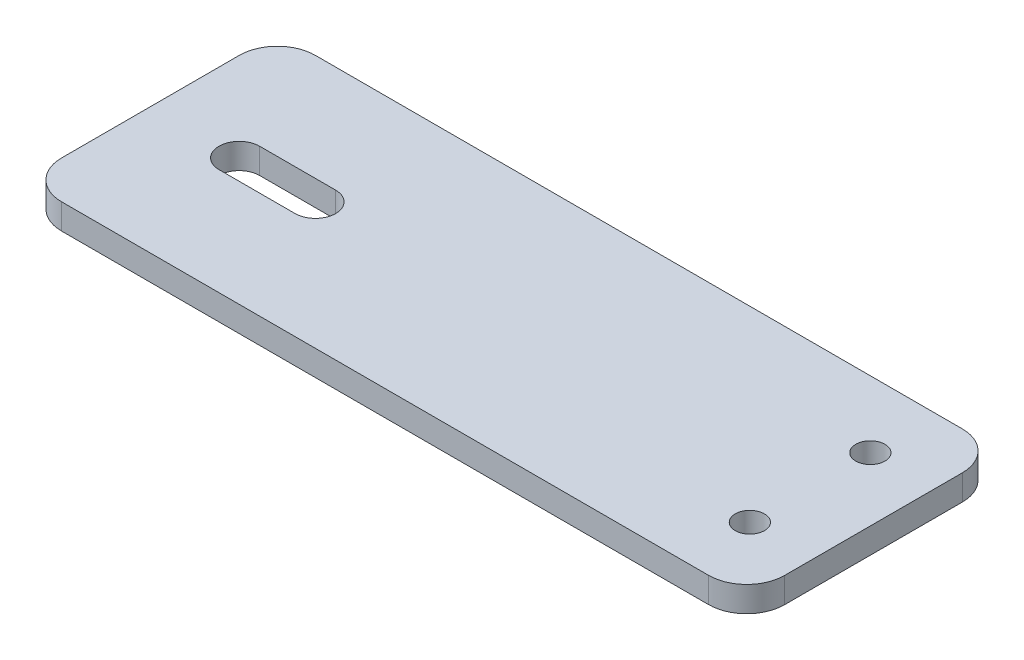
ISO-10303-21;
HEADER;
FILE_DESCRIPTION(('STEP AP214'),'2;1');
FILE_NAME('part.step','',(''),(''),'','','');
FILE_SCHEMA(('AUTOMOTIVE_DESIGN { 1 0 10303 214 1 1 1 1 }'));
ENDSEC;
DATA;
#1=APPLICATION_CONTEXT('core data for automotive mechanical design processes');
#2=APPLICATION_PROTOCOL_DEFINITION('international standard','automotive_design',2000,#1);
#3=PRODUCT_CONTEXT('',#1,'mechanical');
#4=PRODUCT('Part','Part','',(#3));
#5=PRODUCT_RELATED_PRODUCT_CATEGORY('part','',(#4));
#6=PRODUCT_DEFINITION_FORMATION('','',#4);
#7=PRODUCT_DEFINITION_CONTEXT('part definition',#1,'design');
#8=PRODUCT_DEFINITION('design','',#6,#7);
#9=PRODUCT_DEFINITION_SHAPE('','',#8);
#10=(LENGTH_UNIT() NAMED_UNIT(*) SI_UNIT(.MILLI.,.METRE.));
#11=(NAMED_UNIT(*) PLANE_ANGLE_UNIT() SI_UNIT($,.RADIAN.));
#12=(NAMED_UNIT(*) SI_UNIT($,.STERADIAN.) SOLID_ANGLE_UNIT());
#13=UNCERTAINTY_MEASURE_WITH_UNIT(LENGTH_MEASURE(1.E-05),#10,'distance_accuracy_value','');
#14=(GEOMETRIC_REPRESENTATION_CONTEXT(3) GLOBAL_UNCERTAINTY_ASSIGNED_CONTEXT((#13)) GLOBAL_UNIT_ASSIGNED_CONTEXT((#10,
#11,#12)) REPRESENTATION_CONTEXT('',''));
#15=CARTESIAN_POINT('',(0.,0.,0.));
#16=DIRECTION('',(0.,0.,1.));
#17=DIRECTION('',(1.,0.,0.));
#18=AXIS2_PLACEMENT_3D('',#15,#16,#17);
#19=CARTESIAN_POINT('',(0.,2.,0.));
#20=DIRECTION('',(0.,1.,0.));
#21=DIRECTION('',(0.,0.,1.));
#22=AXIS2_PLACEMENT_3D('',#19,#20,#21);
#23=PLANE('',#22);
#24=CARTESIAN_POINT('',(-3.,2.,0.));
#25=DIRECTION('',(0.,1.,0.));
#26=DIRECTION('',(0.,0.,1.));
#27=AXIS2_PLACEMENT_3D('',#24,#25,#26);
#28=CIRCLE('',#27,1.6);
#29=CARTESIAN_POINT('',(-3.,2.,-1.6));
#30=VERTEX_POINT('',#29);
#31=CARTESIAN_POINT('',(-3.,2.,1.6));
#32=VERTEX_POINT('',#31);
#33=EDGE_CURVE('E159',#30,#32,#28,.T.);
#34=ORIENTED_EDGE('',*,*,#33,.F.);
#35=DIRECTION('',(-1.,0.,0.));
#36=VECTOR('',#35,1.);
#37=CARTESIAN_POINT('',(0.,2.,-1.6));
#38=LINE('',#37,#36);
#39=CARTESIAN_POINT('',(3.,2.,-1.6));
#40=VERTEX_POINT('',#39);
#41=EDGE_CURVE('E152',#40,#30,#38,.T.);
#42=ORIENTED_EDGE('',*,*,#41,.F.);
#43=CARTESIAN_POINT('',(3.,2.,0.));
#44=DIRECTION('',(0.,1.,0.));
#45=DIRECTION('',(0.,0.,1.));
#46=AXIS2_PLACEMENT_3D('',#43,#44,#45);
#47=CIRCLE('',#46,1.6);
#48=CARTESIAN_POINT('',(3.,2.,1.6));
#49=VERTEX_POINT('',#48);
#50=EDGE_CURVE('E131',#49,#40,#47,.T.);
#51=ORIENTED_EDGE('',*,*,#50,.F.);
#52=DIRECTION('',(1.,0.,0.));
#53=VECTOR('',#52,1.);
#54=CARTESIAN_POINT('',(0.,2.,1.6));
#55=LINE('',#54,#53);
#56=EDGE_CURVE('E156',#32,#49,#55,.T.);
#57=ORIENTED_EDGE('',*,*,#56,.F.);
#58=EDGE_LOOP('',(#34,#42,#51,#57));
#59=FACE_BOUND('',#58,.T.);
#60=CARTESIAN_POINT('',(42.,2.,4.75));
#61=DIRECTION('',(0.,1.,0.));
#62=DIRECTION('',(0.,0.,1.));
#63=AXIS2_PLACEMENT_3D('',#60,#61,#62);
#64=CIRCLE('',#63,1.15);
#65=CARTESIAN_POINT('',(42.,2.,5.9));
#66=VERTEX_POINT('',#65);
#67=EDGE_CURVE('E168',#66,#66,#64,.T.);
#68=ORIENTED_EDGE('',*,*,#67,.F.);
#69=EDGE_LOOP('',(#68));
#70=FACE_BOUND('',#69,.T.);
#71=DIRECTION('',(-1.,0.,0.));
#72=VECTOR('',#71,1.);
#73=CARTESIAN_POINT('',(10.,2.,-10.));
#74=LINE('',#73,#72);
#75=CARTESIAN_POINT('',(44.,2.,-10.));
#76=VERTEX_POINT('',#75);
#77=CARTESIAN_POINT('',(-7.,2.,-10.));
#78=VERTEX_POINT('',#77);
#79=EDGE_CURVE('E183',#76,#78,#74,.T.);
#80=ORIENTED_EDGE('',*,*,#79,.T.);
#81=CARTESIAN_POINT('',(-7.,2.,-7.));
#82=DIRECTION('',(0.,1.,0.));
#83=DIRECTION('',(0.,0.,1.));
#84=AXIS2_PLACEMENT_3D('',#81,#82,#83);
#85=CIRCLE('',#84,3.);
#86=CARTESIAN_POINT('',(-10.,2.,-7.));
#87=VERTEX_POINT('',#86);
#88=EDGE_CURVE('E219',#78,#87,#85,.T.);
#89=ORIENTED_EDGE('',*,*,#88,.T.);
#90=DIRECTION('',(0.,0.,1.));
#91=VECTOR('',#90,1.);
#92=CARTESIAN_POINT('',(-10.,2.,-10.));
#93=LINE('',#92,#91);
#94=CARTESIAN_POINT('',(-10.,2.,7.));
#95=VERTEX_POINT('',#94);
#96=EDGE_CURVE('E174',#87,#95,#93,.T.);
#97=ORIENTED_EDGE('',*,*,#96,.T.);
#98=CARTESIAN_POINT('',(-7.,2.,7.));
#99=DIRECTION('',(0.,1.,0.));
#100=DIRECTION('',(0.,0.,1.));
#101=AXIS2_PLACEMENT_3D('',#98,#99,#100);
#102=CIRCLE('',#101,3.);
#103=CARTESIAN_POINT('',(-7.,2.,10.));
#104=VERTEX_POINT('',#103);
#105=EDGE_CURVE('E217',#95,#104,#102,.T.);
#106=ORIENTED_EDGE('',*,*,#105,.T.);
#107=DIRECTION('',(1.,0.,0.));
#108=VECTOR('',#107,1.);
#109=CARTESIAN_POINT('',(-10.,2.,10.));
#110=LINE('',#109,#108);
#111=CARTESIAN_POINT('',(44.,2.,10.));
#112=VERTEX_POINT('',#111);
#113=EDGE_CURVE('E177',#104,#112,#110,.T.);
#114=ORIENTED_EDGE('',*,*,#113,.T.);
#115=CARTESIAN_POINT('',(44.,2.,7.));
#116=DIRECTION('',(0.,1.,0.));
#117=DIRECTION('',(0.,0.,1.));
#118=AXIS2_PLACEMENT_3D('',#115,#116,#117);
#119=CIRCLE('',#118,3.);
#120=CARTESIAN_POINT('',(47.,2.,7.));
#121=VERTEX_POINT('',#120);
#122=EDGE_CURVE('E213',#112,#121,#119,.T.);
#123=ORIENTED_EDGE('',*,*,#122,.T.);
#124=DIRECTION('',(0.,0.,-1.));
#125=VECTOR('',#124,1.);
#126=CARTESIAN_POINT('',(47.,2.,-10.));
#127=LINE('',#126,#125);
#128=CARTESIAN_POINT('',(47.,2.,-7.));
#129=VERTEX_POINT('',#128);
#130=EDGE_CURVE('E181',#121,#129,#127,.T.);
#131=ORIENTED_EDGE('',*,*,#130,.T.);
#132=CARTESIAN_POINT('',(44.,2.,-7.));
#133=DIRECTION('',(0.,1.,0.));
#134=DIRECTION('',(0.,0.,1.));
#135=AXIS2_PLACEMENT_3D('',#132,#133,#134);
#136=CIRCLE('',#135,3.);
#137=EDGE_CURVE('E215',#129,#76,#136,.T.);
#138=ORIENTED_EDGE('',*,*,#137,.T.);
#139=EDGE_LOOP('',(#80,#89,#97,#106,#114,#123,#131,#138));
#140=FACE_BOUND('',#139,.T.);
#141=CARTESIAN_POINT('',(42.,2.,-4.75));
#142=DIRECTION('',(0.,1.,0.));
#143=DIRECTION('',(0.,0.,-1.));
#144=AXIS2_PLACEMENT_3D('',#141,#142,#143);
#145=CIRCLE('',#144,1.15);
#146=CARTESIAN_POINT('',(42.,2.,-5.9));
#147=VERTEX_POINT('',#146);
#148=EDGE_CURVE('E162',#147,#147,#145,.T.);
#149=ORIENTED_EDGE('',*,*,#148,.F.);
#150=EDGE_LOOP('',(#149));
#151=FACE_BOUND('',#150,.T.);
#152=ADVANCED_FACE('F34',(#59,#70,#140,#151),#23,.T.);
#153=CARTESIAN_POINT('',(0.,0.,0.));
#154=DIRECTION('',(0.,1.,0.));
#155=DIRECTION('',(0.,0.,1.));
#156=AXIS2_PLACEMENT_3D('',#153,#154,#155);
#157=PLANE('',#156);
#158=DIRECTION('',(0.,0.,1.));
#159=VECTOR('',#158,1.);
#160=CARTESIAN_POINT('',(-10.,0.,-10.));
#161=LINE('',#160,#159);
#162=CARTESIAN_POINT('',(-10.,0.,-7.));
#163=VERTEX_POINT('',#162);
#164=CARTESIAN_POINT('',(-10.,0.,7.));
#165=VERTEX_POINT('',#164);
#166=EDGE_CURVE('E171',#163,#165,#161,.T.);
#167=ORIENTED_EDGE('',*,*,#166,.F.);
#168=CARTESIAN_POINT('',(-7.,0.,-7.));
#169=DIRECTION('',(0.,1.,0.));
#170=DIRECTION('',(0.,0.,1.));
#171=AXIS2_PLACEMENT_3D('',#168,#169,#170);
#172=CIRCLE('',#171,3.);
#173=CARTESIAN_POINT('',(-7.,0.,-10.));
#174=VERTEX_POINT('',#173);
#175=EDGE_CURVE('E206',#163,#174,#172,.F.);
#176=ORIENTED_EDGE('',*,*,#175,.T.);
#177=DIRECTION('',(-1.,0.,0.));
#178=VECTOR('',#177,1.);
#179=CARTESIAN_POINT('',(-10.,0.,-10.));
#180=LINE('',#179,#178);
#181=CARTESIAN_POINT('',(44.,0.,-10.));
#182=VERTEX_POINT('',#181);
#183=EDGE_CURVE('E178',#182,#174,#180,.T.);
#184=ORIENTED_EDGE('',*,*,#183,.F.);
#185=CARTESIAN_POINT('',(44.,0.,-7.));
#186=DIRECTION('',(0.,1.,0.));
#187=DIRECTION('',(0.,0.,1.));
#188=AXIS2_PLACEMENT_3D('',#185,#186,#187);
#189=CIRCLE('',#188,3.);
#190=CARTESIAN_POINT('',(47.,0.,-7.));
#191=VERTEX_POINT('',#190);
#192=EDGE_CURVE('E202',#182,#191,#189,.F.);
#193=ORIENTED_EDGE('',*,*,#192,.T.);
#194=DIRECTION('',(0.,0.,-1.));
#195=VECTOR('',#194,1.);
#196=CARTESIAN_POINT('',(47.,0.,-10.));
#197=LINE('',#196,#195);
#198=CARTESIAN_POINT('',(47.,0.,7.));
#199=VERTEX_POINT('',#198);
#200=EDGE_CURVE('E192',#199,#191,#197,.T.);
#201=ORIENTED_EDGE('',*,*,#200,.F.);
#202=CARTESIAN_POINT('',(44.,0.,7.));
#203=DIRECTION('',(0.,1.,0.));
#204=DIRECTION('',(0.,0.,1.));
#205=AXIS2_PLACEMENT_3D('',#202,#203,#204);
#206=CIRCLE('',#205,3.);
#207=CARTESIAN_POINT('',(44.,0.,10.));
#208=VERTEX_POINT('',#207);
#209=EDGE_CURVE('E200',#199,#208,#206,.F.);
#210=ORIENTED_EDGE('',*,*,#209,.T.);
#211=DIRECTION('',(1.,0.,0.));
#212=VECTOR('',#211,1.);
#213=CARTESIAN_POINT('',(10.,0.,10.));
#214=LINE('',#213,#212);
#215=CARTESIAN_POINT('',(-7.,0.,10.));
#216=VERTEX_POINT('',#215);
#217=EDGE_CURVE('E189',#216,#208,#214,.T.);
#218=ORIENTED_EDGE('',*,*,#217,.F.);
#219=CARTESIAN_POINT('',(-7.,0.,7.));
#220=DIRECTION('',(0.,1.,0.));
#221=DIRECTION('',(0.,0.,1.));
#222=AXIS2_PLACEMENT_3D('',#219,#220,#221);
#223=CIRCLE('',#222,3.);
#224=EDGE_CURVE('E204',#216,#165,#223,.F.);
#225=ORIENTED_EDGE('',*,*,#224,.T.);
#226=EDGE_LOOP('',(#167,#176,#184,#193,#201,#210,#218,#225));
#227=FACE_BOUND('',#226,.T.);
#228=DIRECTION('',(1.,0.,0.));
#229=VECTOR('',#228,1.);
#230=CARTESIAN_POINT('',(-3.,0.,-1.6));
#231=LINE('',#230,#229);
#232=CARTESIAN_POINT('',(-3.,0.,-1.6));
#233=VERTEX_POINT('',#232);
#234=CARTESIAN_POINT('',(3.,0.,-1.6));
#235=VERTEX_POINT('',#234);
#236=EDGE_CURVE('E49',#233,#235,#231,.T.);
#237=ORIENTED_EDGE('',*,*,#236,.F.);
#238=CARTESIAN_POINT('',(-3.,0.,0.));
#239=DIRECTION('',(0.,-1.,0.));
#240=DIRECTION('',(0.,0.,-1.));
#241=AXIS2_PLACEMENT_3D('',#238,#239,#240);
#242=CIRCLE('',#241,1.6);
#243=CARTESIAN_POINT('',(-3.,0.,1.6));
#244=VERTEX_POINT('',#243);
#245=EDGE_CURVE('E140',#244,#233,#242,.T.);
#246=ORIENTED_EDGE('',*,*,#245,.F.);
#247=DIRECTION('',(-1.,0.,0.));
#248=VECTOR('',#247,1.);
#249=CARTESIAN_POINT('',(-3.,0.,1.6));
#250=LINE('',#249,#248);
#251=CARTESIAN_POINT('',(3.,0.,1.6));
#252=VERTEX_POINT('',#251);
#253=EDGE_CURVE('E144',#252,#244,#250,.T.);
#254=ORIENTED_EDGE('',*,*,#253,.F.);
#255=CARTESIAN_POINT('',(3.,0.,0.));
#256=DIRECTION('',(0.,-1.,0.));
#257=DIRECTION('',(0.,0.,-1.));
#258=AXIS2_PLACEMENT_3D('',#255,#256,#257);
#259=CIRCLE('',#258,1.6);
#260=EDGE_CURVE('E128',#235,#252,#259,.T.);
#261=ORIENTED_EDGE('',*,*,#260,.F.);
#262=EDGE_LOOP('',(#237,#246,#254,#261));
#263=FACE_BOUND('',#262,.T.);
#264=CARTESIAN_POINT('',(42.,0.,4.75));
#265=DIRECTION('',(0.,1.,0.));
#266=DIRECTION('',(0.,0.,1.));
#267=AXIS2_PLACEMENT_3D('',#264,#265,#266);
#268=CIRCLE('',#267,1.15);
#269=CARTESIAN_POINT('',(42.,0.,5.9));
#270=VERTEX_POINT('',#269);
#271=EDGE_CURVE('E165',#270,#270,#268,.T.);
#272=ORIENTED_EDGE('',*,*,#271,.T.);
#273=EDGE_LOOP('',(#272));
#274=FACE_BOUND('',#273,.T.);
#275=CARTESIAN_POINT('',(42.,0.,-4.75));
#276=DIRECTION('',(0.,1.,0.));
#277=DIRECTION('',(0.,0.,-1.));
#278=AXIS2_PLACEMENT_3D('',#275,#276,#277);
#279=CIRCLE('',#278,1.15);
#280=CARTESIAN_POINT('',(42.,0.,-5.9));
#281=VERTEX_POINT('',#280);
#282=EDGE_CURVE('E161',#281,#281,#279,.T.);
#283=ORIENTED_EDGE('',*,*,#282,.T.);
#284=EDGE_LOOP('',(#283));
#285=FACE_BOUND('',#284,.T.);
#286=ADVANCED_FACE('F142',(#227,#263,#274,#285),#157,.F.);
#287=CARTESIAN_POINT('',(-10.,2.,-10.));
#288=DIRECTION('',(1.,0.,0.));
#289=DIRECTION('',(0.,0.,-1.));
#290=AXIS2_PLACEMENT_3D('',#287,#288,#289);
#291=PLANE('',#290);
#292=ORIENTED_EDGE('',*,*,#96,.F.);
#293=DIRECTION('',(0.,-1.,0.));
#294=VECTOR('',#293,1.);
#295=CARTESIAN_POINT('',(-10.,2.,-7.));
#296=LINE('',#295,#294);
#297=EDGE_CURVE('E197',#87,#163,#296,.T.);
#298=ORIENTED_EDGE('',*,*,#297,.T.);
#299=ORIENTED_EDGE('',*,*,#166,.T.);
#300=DIRECTION('',(0.,-1.,0.));
#301=VECTOR('',#300,1.);
#302=CARTESIAN_POINT('',(-10.,2.,7.));
#303=LINE('',#302,#301);
#304=EDGE_CURVE('E186',#165,#95,#303,.F.);
#305=ORIENTED_EDGE('',*,*,#304,.T.);
#306=EDGE_LOOP('',(#292,#298,#299,#305));
#307=FACE_BOUND('',#306,.T.);
#308=ADVANCED_FACE('F251',(#307),#291,.F.);
#309=CARTESIAN_POINT('',(10.,2.,10.));
#310=DIRECTION('',(0.,0.,-1.));
#311=DIRECTION('',(-1.,0.,0.));
#312=AXIS2_PLACEMENT_3D('',#309,#310,#311);
#313=PLANE('',#312);
#314=ORIENTED_EDGE('',*,*,#113,.F.);
#315=DIRECTION('',(0.,-1.,0.));
#316=VECTOR('',#315,1.);
#317=CARTESIAN_POINT('',(-7.,2.,10.));
#318=LINE('',#317,#316);
#319=EDGE_CURVE('E223',#104,#216,#318,.T.);
#320=ORIENTED_EDGE('',*,*,#319,.T.);
#321=ORIENTED_EDGE('',*,*,#217,.T.);
#322=DIRECTION('',(0.,-1.,0.));
#323=VECTOR('',#322,1.);
#324=CARTESIAN_POINT('',(44.,2.,10.));
#325=LINE('',#324,#323);
#326=EDGE_CURVE('E221',#208,#112,#325,.F.);
#327=ORIENTED_EDGE('',*,*,#326,.T.);
#328=EDGE_LOOP('',(#314,#320,#321,#327));
#329=FACE_BOUND('',#328,.T.);
#330=ADVANCED_FACE('F259',(#329),#313,.F.);
#331=CARTESIAN_POINT('',(47.,2.,-10.));
#332=DIRECTION('',(-1.,0.,0.));
#333=DIRECTION('',(0.,0.,1.));
#334=AXIS2_PLACEMENT_3D('',#331,#332,#333);
#335=PLANE('',#334);
#336=ORIENTED_EDGE('',*,*,#200,.T.);
#337=DIRECTION('',(0.,-1.,0.));
#338=VECTOR('',#337,1.);
#339=CARTESIAN_POINT('',(47.,2.,-7.));
#340=LINE('',#339,#338);
#341=EDGE_CURVE('E11',#191,#129,#340,.F.);
#342=ORIENTED_EDGE('',*,*,#341,.T.);
#343=ORIENTED_EDGE('',*,*,#130,.F.);
#344=DIRECTION('',(0.,-1.,0.));
#345=VECTOR('',#344,1.);
#346=CARTESIAN_POINT('',(47.,2.,7.));
#347=LINE('',#346,#345);
#348=EDGE_CURVE('E42',#121,#199,#347,.T.);
#349=ORIENTED_EDGE('',*,*,#348,.T.);
#350=EDGE_LOOP('',(#336,#342,#343,#349));
#351=FACE_BOUND('',#350,.T.);
#352=ADVANCED_FACE('F228',(#351),#335,.F.);
#353=CARTESIAN_POINT('',(-10.,2.,-10.));
#354=DIRECTION('',(0.,0.,1.));
#355=DIRECTION('',(1.,0.,0.));
#356=AXIS2_PLACEMENT_3D('',#353,#354,#355);
#357=PLANE('',#356);
#358=ORIENTED_EDGE('',*,*,#183,.T.);
#359=DIRECTION('',(0.,-1.,0.));
#360=VECTOR('',#359,1.);
#361=CARTESIAN_POINT('',(-7.,2.,-10.));
#362=LINE('',#361,#360);
#363=EDGE_CURVE('E211',#174,#78,#362,.F.);
#364=ORIENTED_EDGE('',*,*,#363,.T.);
#365=ORIENTED_EDGE('',*,*,#79,.F.);
#366=DIRECTION('',(0.,-1.,0.));
#367=VECTOR('',#366,1.);
#368=CARTESIAN_POINT('',(44.,2.,-10.));
#369=LINE('',#368,#367);
#370=EDGE_CURVE('E208',#76,#182,#369,.T.);
#371=ORIENTED_EDGE('',*,*,#370,.T.);
#372=EDGE_LOOP('',(#358,#364,#365,#371));
#373=FACE_BOUND('',#372,.T.);
#374=ADVANCED_FACE('F241',(#373),#357,.F.);
#375=CARTESIAN_POINT('',(42.,2.,4.75));
#376=DIRECTION('',(0.,-1.,0.));
#377=DIRECTION('',(0.,0.,-1.));
#378=AXIS2_PLACEMENT_3D('',#375,#376,#377);
#379=CYLINDRICAL_SURFACE('',#378,1.15);
#380=ORIENTED_EDGE('',*,*,#67,.T.);
#381=EDGE_LOOP('',(#380));
#382=FACE_BOUND('',#381,.T.);
#383=ORIENTED_EDGE('',*,*,#271,.F.);
#384=EDGE_LOOP('',(#383));
#385=FACE_BOUND('',#384,.T.);
#386=ADVANCED_FACE('F279',(#382,#385),#379,.F.);
#387=CARTESIAN_POINT('',(42.,2.,-4.75));
#388=DIRECTION('',(0.,-1.,0.));
#389=DIRECTION('',(0.,0.,-1.));
#390=AXIS2_PLACEMENT_3D('',#387,#388,#389);
#391=CYLINDRICAL_SURFACE('',#390,1.15);
#392=ORIENTED_EDGE('',*,*,#148,.T.);
#393=EDGE_LOOP('',(#392));
#394=FACE_BOUND('',#393,.T.);
#395=ORIENTED_EDGE('',*,*,#282,.F.);
#396=EDGE_LOOP('',(#395));
#397=FACE_BOUND('',#396,.T.);
#398=ADVANCED_FACE('F292',(#394,#397),#391,.F.);
#399=CARTESIAN_POINT('',(-7.,2.,-7.));
#400=DIRECTION('',(0.,-1.,0.));
#401=DIRECTION('',(0.,0.,-1.));
#402=AXIS2_PLACEMENT_3D('',#399,#400,#401);
#403=CYLINDRICAL_SURFACE('',#402,3.);
#404=ORIENTED_EDGE('',*,*,#88,.F.);
#405=ORIENTED_EDGE('',*,*,#363,.F.);
#406=ORIENTED_EDGE('',*,*,#175,.F.);
#407=ORIENTED_EDGE('',*,*,#297,.F.);
#408=EDGE_LOOP('',(#404,#405,#406,#407));
#409=FACE_BOUND('',#408,.T.);
#410=ADVANCED_FACE('F249',(#409),#403,.T.);
#411=CARTESIAN_POINT('',(-7.,2.,7.));
#412=DIRECTION('',(0.,-1.,0.));
#413=DIRECTION('',(0.,0.,-1.));
#414=AXIS2_PLACEMENT_3D('',#411,#412,#413);
#415=CYLINDRICAL_SURFACE('',#414,3.);
#416=ORIENTED_EDGE('',*,*,#105,.F.);
#417=ORIENTED_EDGE('',*,*,#304,.F.);
#418=ORIENTED_EDGE('',*,*,#224,.F.);
#419=ORIENTED_EDGE('',*,*,#319,.F.);
#420=EDGE_LOOP('',(#416,#417,#418,#419));
#421=FACE_BOUND('',#420,.T.);
#422=ADVANCED_FACE('F256',(#421),#415,.T.);
#423=CARTESIAN_POINT('',(44.,2.,-7.));
#424=DIRECTION('',(0.,-1.,0.));
#425=DIRECTION('',(0.,0.,-1.));
#426=AXIS2_PLACEMENT_3D('',#423,#424,#425);
#427=CYLINDRICAL_SURFACE('',#426,3.);
#428=ORIENTED_EDGE('',*,*,#137,.F.);
#429=ORIENTED_EDGE('',*,*,#341,.F.);
#430=ORIENTED_EDGE('',*,*,#192,.F.);
#431=ORIENTED_EDGE('',*,*,#370,.F.);
#432=EDGE_LOOP('',(#428,#429,#430,#431));
#433=FACE_BOUND('',#432,.T.);
#434=ADVANCED_FACE('F238',(#433),#427,.T.);
#435=CARTESIAN_POINT('',(44.,2.,7.));
#436=DIRECTION('',(0.,-1.,0.));
#437=DIRECTION('',(0.,0.,-1.));
#438=AXIS2_PLACEMENT_3D('',#435,#436,#437);
#439=CYLINDRICAL_SURFACE('',#438,3.);
#440=ORIENTED_EDGE('',*,*,#122,.F.);
#441=ORIENTED_EDGE('',*,*,#326,.F.);
#442=ORIENTED_EDGE('',*,*,#209,.F.);
#443=ORIENTED_EDGE('',*,*,#348,.F.);
#444=EDGE_LOOP('',(#440,#441,#442,#443));
#445=FACE_BOUND('',#444,.T.);
#446=ADVANCED_FACE('F36',(#445),#439,.T.);
#447=CARTESIAN_POINT('',(-3.,10.,1.6));
#448=DIRECTION('',(0.,0.,1.));
#449=DIRECTION('',(1.,0.,0.));
#450=AXIS2_PLACEMENT_3D('',#447,#448,#449);
#451=PLANE('',#450);
#452=ORIENTED_EDGE('',*,*,#56,.T.);
#453=DIRECTION('',(0.,-1.,0.));
#454=VECTOR('',#453,1.);
#455=CARTESIAN_POINT('',(3.,10.,1.6));
#456=LINE('',#455,#454);
#457=EDGE_CURVE('E134',#49,#252,#456,.T.);
#458=ORIENTED_EDGE('',*,*,#457,.T.);
#459=ORIENTED_EDGE('',*,*,#253,.T.);
#460=DIRECTION('',(0.,-1.,0.));
#461=VECTOR('',#460,1.);
#462=CARTESIAN_POINT('',(-3.,10.,1.6));
#463=LINE('',#462,#461);
#464=EDGE_CURVE('E149',#32,#244,#463,.T.);
#465=ORIENTED_EDGE('',*,*,#464,.F.);
#466=EDGE_LOOP('',(#452,#458,#459,#465));
#467=FACE_BOUND('',#466,.T.);
#468=ADVANCED_FACE('F262',(#467),#451,.F.);
#469=CARTESIAN_POINT('',(-3.,10.,-1.6));
#470=DIRECTION('',(0.,0.,-1.));
#471=DIRECTION('',(-1.,0.,0.));
#472=AXIS2_PLACEMENT_3D('',#469,#470,#471);
#473=PLANE('',#472);
#474=ORIENTED_EDGE('',*,*,#41,.T.);
#475=DIRECTION('',(0.,-1.,0.));
#476=VECTOR('',#475,1.);
#477=CARTESIAN_POINT('',(-3.,10.,-1.6));
#478=LINE('',#477,#476);
#479=EDGE_CURVE('E135',#30,#233,#478,.T.);
#480=ORIENTED_EDGE('',*,*,#479,.T.);
#481=ORIENTED_EDGE('',*,*,#236,.T.);
#482=DIRECTION('',(0.,-1.,0.));
#483=VECTOR('',#482,1.);
#484=CARTESIAN_POINT('',(3.,10.,-1.6));
#485=LINE('',#484,#483);
#486=EDGE_CURVE('E125',#40,#235,#485,.T.);
#487=ORIENTED_EDGE('',*,*,#486,.F.);
#488=EDGE_LOOP('',(#474,#480,#481,#487));
#489=FACE_BOUND('',#488,.T.);
#490=ADVANCED_FACE('F138',(#489),#473,.F.);
#491=CARTESIAN_POINT('',(-3.,10.,0.));
#492=DIRECTION('',(0.,-1.,0.));
#493=DIRECTION('',(0.,0.,-1.));
#494=AXIS2_PLACEMENT_3D('',#491,#492,#493);
#495=CYLINDRICAL_SURFACE('',#494,1.6);
#496=ORIENTED_EDGE('',*,*,#33,.T.);
#497=ORIENTED_EDGE('',*,*,#464,.T.);
#498=ORIENTED_EDGE('',*,*,#245,.T.);
#499=ORIENTED_EDGE('',*,*,#479,.F.);
#500=EDGE_LOOP('',(#496,#497,#498,#499));
#501=FACE_BOUND('',#500,.T.);
#502=ADVANCED_FACE('F333',(#501),#495,.F.);
#503=CARTESIAN_POINT('',(3.,10.,0.));
#504=DIRECTION('',(0.,-1.,0.));
#505=DIRECTION('',(0.,0.,-1.));
#506=AXIS2_PLACEMENT_3D('',#503,#504,#505);
#507=CYLINDRICAL_SURFACE('',#506,1.6);
#508=ORIENTED_EDGE('',*,*,#50,.T.);
#509=ORIENTED_EDGE('',*,*,#486,.T.);
#510=ORIENTED_EDGE('',*,*,#260,.T.);
#511=ORIENTED_EDGE('',*,*,#457,.F.);
#512=EDGE_LOOP('',(#508,#509,#510,#511));
#513=FACE_BOUND('',#512,.T.);
#514=ADVANCED_FACE('F126',(#513),#507,.F.);
#515=CLOSED_SHELL('',(#152,#286,#308,#330,#352,#374,#386,#398,#410,#422,#434,#446,#468,#490,
#502,#514));
#516=MANIFOLD_SOLID_BREP('B2',#515);
#517=ADVANCED_BREP_SHAPE_REPRESENTATION('',(#18,#516),#14);
#518=SHAPE_DEFINITION_REPRESENTATION(#9,#517);
ENDSEC;
END-ISO-10303-21;
